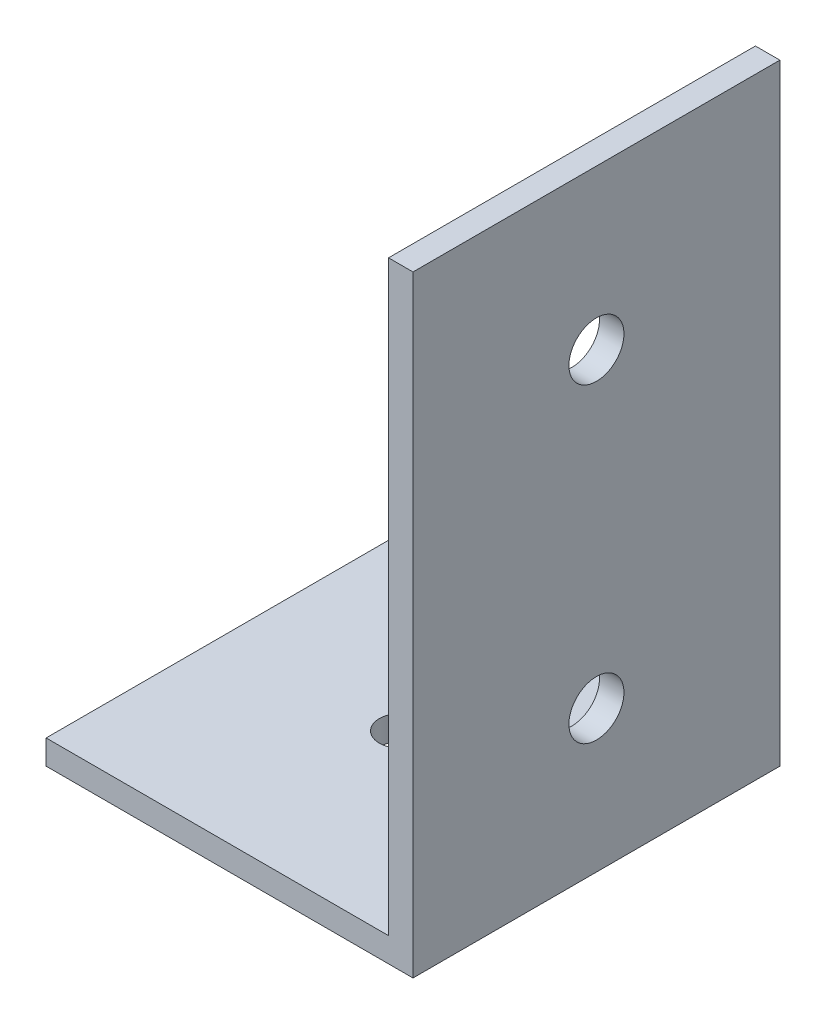
ISO-10303-21;
HEADER;
FILE_DESCRIPTION(('STEP AP214'),'2;1');
FILE_NAME('part.step','',(''),(''),'','','');
FILE_SCHEMA(('AUTOMOTIVE_DESIGN { 1 0 10303 214 1 1 1 1 }'));
ENDSEC;
DATA;
#1=APPLICATION_CONTEXT('core data for automotive mechanical design processes');
#2=APPLICATION_PROTOCOL_DEFINITION('international standard','automotive_design',2000,#1);
#3=PRODUCT_CONTEXT('',#1,'mechanical');
#4=PRODUCT('Part','Part','',(#3));
#5=PRODUCT_RELATED_PRODUCT_CATEGORY('part','',(#4));
#6=PRODUCT_DEFINITION_FORMATION('','',#4);
#7=PRODUCT_DEFINITION_CONTEXT('part definition',#1,'design');
#8=PRODUCT_DEFINITION('design','',#6,#7);
#9=PRODUCT_DEFINITION_SHAPE('','',#8);
#10=(LENGTH_UNIT() NAMED_UNIT(*) SI_UNIT(.MILLI.,.METRE.));
#11=(NAMED_UNIT(*) PLANE_ANGLE_UNIT() SI_UNIT($,.RADIAN.));
#12=(NAMED_UNIT(*) SI_UNIT($,.STERADIAN.) SOLID_ANGLE_UNIT());
#13=UNCERTAINTY_MEASURE_WITH_UNIT(LENGTH_MEASURE(1.E-05),#10,'distance_accuracy_value','');
#14=(GEOMETRIC_REPRESENTATION_CONTEXT(3) GLOBAL_UNCERTAINTY_ASSIGNED_CONTEXT((#13)) GLOBAL_UNIT_ASSIGNED_CONTEXT((#10,
#11,#12)) REPRESENTATION_CONTEXT('',''));
#15=CARTESIAN_POINT('',(0.,0.,0.));
#16=DIRECTION('',(0.,0.,1.));
#17=DIRECTION('',(1.,0.,0.));
#18=AXIS2_PLACEMENT_3D('',#15,#16,#17);
#19=CARTESIAN_POINT('',(0.,50.,30.));
#20=DIRECTION('',(-1.,0.,0.));
#21=DIRECTION('',(0.,-1.,0.));
#22=AXIS2_PLACEMENT_3D('',#19,#20,#21);
#23=PLANE('',#22);
#24=CARTESIAN_POINT('',(0.,11.6,15.));
#25=DIRECTION('',(-1.,0.,0.));
#26=DIRECTION('',(0.,-1.,0.));
#27=AXIS2_PLACEMENT_3D('',#24,#25,#26);
#28=CIRCLE('',#27,2.25);
#29=CARTESIAN_POINT('',(0.,9.35,15.));
#30=VERTEX_POINT('',#29);
#31=EDGE_CURVE('E161',#30,#30,#28,.T.);
#32=ORIENTED_EDGE('',*,*,#31,.T.);
#33=EDGE_LOOP('',(#32));
#34=FACE_BOUND('',#33,.T.);
#35=CARTESIAN_POINT('',(0.,37.,15.));
#36=DIRECTION('',(-1.,0.,0.));
#37=DIRECTION('',(0.,-1.,0.));
#38=AXIS2_PLACEMENT_3D('',#35,#36,#37);
#39=CIRCLE('',#38,2.25);
#40=CARTESIAN_POINT('',(0.,34.75,15.));
#41=VERTEX_POINT('',#40);
#42=EDGE_CURVE('E120',#41,#41,#39,.T.);
#43=ORIENTED_EDGE('',*,*,#42,.T.);
#44=EDGE_LOOP('',(#43));
#45=FACE_BOUND('',#44,.T.);
#46=DIRECTION('',(0.,1.,0.));
#47=VECTOR('',#46,1.);
#48=CARTESIAN_POINT('',(0.,50.,0.));
#49=LINE('',#48,#47);
#50=CARTESIAN_POINT('',(0.,0.,0.));
#51=VERTEX_POINT('',#50);
#52=CARTESIAN_POINT('',(0.,50.,0.));
#53=VERTEX_POINT('',#52);
#54=EDGE_CURVE('E116',#51,#53,#49,.T.);
#55=ORIENTED_EDGE('',*,*,#54,.T.);
#56=DIRECTION('',(0.,0.,-1.));
#57=VECTOR('',#56,1.);
#58=CARTESIAN_POINT('',(0.,50.,30.));
#59=LINE('',#58,#57);
#60=CARTESIAN_POINT('',(0.,50.,30.));
#61=VERTEX_POINT('',#60);
#62=EDGE_CURVE('E11',#61,#53,#59,.T.);
#63=ORIENTED_EDGE('',*,*,#62,.F.);
#64=DIRECTION('',(0.,1.,0.));
#65=VECTOR('',#64,1.);
#66=CARTESIAN_POINT('',(0.,50.,30.));
#67=LINE('',#66,#65);
#68=CARTESIAN_POINT('',(0.,0.,30.));
#69=VERTEX_POINT('',#68);
#70=EDGE_CURVE('E127',#69,#61,#67,.T.);
#71=ORIENTED_EDGE('',*,*,#70,.F.);
#72=DIRECTION('',(0.,0.,-1.));
#73=VECTOR('',#72,1.);
#74=CARTESIAN_POINT('',(0.,0.,30.));
#75=LINE('',#74,#73);
#76=EDGE_CURVE('E112',#69,#51,#75,.T.);
#77=ORIENTED_EDGE('',*,*,#76,.T.);
#78=EDGE_LOOP('',(#55,#63,#71,#77));
#79=FACE_BOUND('',#78,.T.);
#80=ADVANCED_FACE('F32',(#34,#45,#79),#23,.F.);
#81=CARTESIAN_POINT('',(-2.,50.,30.));
#82=DIRECTION('',(0.,-1.,0.));
#83=DIRECTION('',(0.,0.,-1.));
#84=AXIS2_PLACEMENT_3D('',#81,#82,#83);
#85=PLANE('',#84);
#86=DIRECTION('',(-1.,0.,0.));
#87=VECTOR('',#86,1.);
#88=CARTESIAN_POINT('',(-2.,50.,0.));
#89=LINE('',#88,#87);
#90=CARTESIAN_POINT('',(-2.,50.,0.));
#91=VERTEX_POINT('',#90);
#92=EDGE_CURVE('E119',#53,#91,#89,.T.);
#93=ORIENTED_EDGE('',*,*,#92,.T.);
#94=DIRECTION('',(0.,0.,-1.));
#95=VECTOR('',#94,1.);
#96=CARTESIAN_POINT('',(-2.,50.,30.));
#97=LINE('',#96,#95);
#98=CARTESIAN_POINT('',(-2.,50.,30.));
#99=VERTEX_POINT('',#98);
#100=EDGE_CURVE('E40',#99,#91,#97,.T.);
#101=ORIENTED_EDGE('',*,*,#100,.F.);
#102=DIRECTION('',(-1.,0.,0.));
#103=VECTOR('',#102,1.);
#104=CARTESIAN_POINT('',(-2.,50.,30.));
#105=LINE('',#104,#103);
#106=EDGE_CURVE('E85',#61,#99,#105,.T.);
#107=ORIENTED_EDGE('',*,*,#106,.F.);
#108=ORIENTED_EDGE('',*,*,#62,.T.);
#109=EDGE_LOOP('',(#93,#101,#107,#108));
#110=FACE_BOUND('',#109,.T.);
#111=ADVANCED_FACE('F153',(#110),#85,.F.);
#112=CARTESIAN_POINT('',(-2.,2.,30.));
#113=DIRECTION('',(1.,0.,0.));
#114=DIRECTION('',(0.,1.,0.));
#115=AXIS2_PLACEMENT_3D('',#112,#113,#114);
#116=PLANE('',#115);
#117=CARTESIAN_POINT('',(-2.,11.6,15.));
#118=DIRECTION('',(-1.,0.,0.));
#119=DIRECTION('',(0.,-1.,0.));
#120=AXIS2_PLACEMENT_3D('',#117,#118,#119);
#121=CIRCLE('',#120,2.25);
#122=CARTESIAN_POINT('',(-2.,9.35,15.));
#123=VERTEX_POINT('',#122);
#124=EDGE_CURVE('E170',#123,#123,#121,.T.);
#125=ORIENTED_EDGE('',*,*,#124,.F.);
#126=EDGE_LOOP('',(#125));
#127=FACE_BOUND('',#126,.T.);
#128=CARTESIAN_POINT('',(-2.,37.,15.));
#129=DIRECTION('',(-1.,0.,0.));
#130=DIRECTION('',(0.,-1.,0.));
#131=AXIS2_PLACEMENT_3D('',#128,#129,#130);
#132=CIRCLE('',#131,2.25);
#133=CARTESIAN_POINT('',(-2.,34.75,15.));
#134=VERTEX_POINT('',#133);
#135=EDGE_CURVE('E165',#134,#134,#132,.T.);
#136=ORIENTED_EDGE('',*,*,#135,.F.);
#137=EDGE_LOOP('',(#136));
#138=FACE_BOUND('',#137,.T.);
#139=DIRECTION('',(0.,-1.,0.));
#140=VECTOR('',#139,1.);
#141=CARTESIAN_POINT('',(-2.,2.,0.));
#142=LINE('',#141,#140);
#143=CARTESIAN_POINT('',(-2.,2.,0.));
#144=VERTEX_POINT('',#143);
#145=EDGE_CURVE('E122',#91,#144,#142,.T.);
#146=ORIENTED_EDGE('',*,*,#145,.T.);
#147=DIRECTION('',(0.,0.,-1.));
#148=VECTOR('',#147,1.);
#149=CARTESIAN_POINT('',(-2.,2.,30.));
#150=LINE('',#149,#148);
#151=CARTESIAN_POINT('',(-2.,2.,30.));
#152=VERTEX_POINT('',#151);
#153=EDGE_CURVE('E107',#152,#144,#150,.T.);
#154=ORIENTED_EDGE('',*,*,#153,.F.);
#155=DIRECTION('',(0.,-1.,0.));
#156=VECTOR('',#155,1.);
#157=CARTESIAN_POINT('',(-2.,2.,30.));
#158=LINE('',#157,#156);
#159=EDGE_CURVE('E98',#99,#152,#158,.T.);
#160=ORIENTED_EDGE('',*,*,#159,.F.);
#161=ORIENTED_EDGE('',*,*,#100,.T.);
#162=EDGE_LOOP('',(#146,#154,#160,#161));
#163=FACE_BOUND('',#162,.T.);
#164=ADVANCED_FACE('F133',(#127,#138,#163),#116,.F.);
#165=CARTESIAN_POINT('',(-30.,2.,30.));
#166=DIRECTION('',(0.,-1.,0.));
#167=DIRECTION('',(0.,0.,-1.));
#168=AXIS2_PLACEMENT_3D('',#165,#166,#167);
#169=PLANE('',#168);
#170=CARTESIAN_POINT('',(-16.,2.,15.));
#171=DIRECTION('',(0.,1.,0.));
#172=DIRECTION('',(0.,0.,1.));
#173=AXIS2_PLACEMENT_3D('',#170,#171,#172);
#174=CIRCLE('',#173,1.75);
#175=CARTESIAN_POINT('',(-16.,2.,16.75));
#176=VERTEX_POINT('',#175);
#177=EDGE_CURVE('E177',#176,#176,#174,.T.);
#178=ORIENTED_EDGE('',*,*,#177,.F.);
#179=EDGE_LOOP('',(#178));
#180=FACE_BOUND('',#179,.T.);
#181=DIRECTION('',(-1.,0.,0.));
#182=VECTOR('',#181,1.);
#183=CARTESIAN_POINT('',(-30.,2.,0.));
#184=LINE('',#183,#182);
#185=CARTESIAN_POINT('',(-30.,2.,0.));
#186=VERTEX_POINT('',#185);
#187=EDGE_CURVE('E106',#144,#186,#184,.T.);
#188=ORIENTED_EDGE('',*,*,#187,.T.);
#189=DIRECTION('',(0.,0.,-1.));
#190=VECTOR('',#189,1.);
#191=CARTESIAN_POINT('',(-30.,2.,30.));
#192=LINE('',#191,#190);
#193=CARTESIAN_POINT('',(-30.,2.,30.));
#194=VERTEX_POINT('',#193);
#195=EDGE_CURVE('E103',#194,#186,#192,.T.);
#196=ORIENTED_EDGE('',*,*,#195,.F.);
#197=DIRECTION('',(-1.,0.,0.));
#198=VECTOR('',#197,1.);
#199=CARTESIAN_POINT('',(-30.,2.,30.));
#200=LINE('',#199,#198);
#201=EDGE_CURVE('E92',#152,#194,#200,.T.);
#202=ORIENTED_EDGE('',*,*,#201,.F.);
#203=ORIENTED_EDGE('',*,*,#153,.T.);
#204=EDGE_LOOP('',(#188,#196,#202,#203));
#205=FACE_BOUND('',#204,.T.);
#206=ADVANCED_FACE('F104',(#180,#205),#169,.F.);
#207=CARTESIAN_POINT('',(-30.,0.,30.));
#208=DIRECTION('',(1.,0.,0.));
#209=DIRECTION('',(0.,0.,-1.));
#210=AXIS2_PLACEMENT_3D('',#207,#208,#209);
#211=PLANE('',#210);
#212=DIRECTION('',(0.,-1.,0.));
#213=VECTOR('',#212,1.);
#214=CARTESIAN_POINT('',(-30.,0.,0.));
#215=LINE('',#214,#213);
#216=CARTESIAN_POINT('',(-30.,0.,0.));
#217=VERTEX_POINT('',#216);
#218=EDGE_CURVE('E71',#186,#217,#215,.T.);
#219=ORIENTED_EDGE('',*,*,#218,.T.);
#220=DIRECTION('',(0.,0.,-1.));
#221=VECTOR('',#220,1.);
#222=CARTESIAN_POINT('',(-30.,0.,30.));
#223=LINE('',#222,#221);
#224=CARTESIAN_POINT('',(-30.,0.,30.));
#225=VERTEX_POINT('',#224);
#226=EDGE_CURVE('E108',#225,#217,#223,.T.);
#227=ORIENTED_EDGE('',*,*,#226,.F.);
#228=DIRECTION('',(0.,-1.,0.));
#229=VECTOR('',#228,1.);
#230=CARTESIAN_POINT('',(-30.,0.,30.));
#231=LINE('',#230,#229);
#232=EDGE_CURVE('E96',#194,#225,#231,.T.);
#233=ORIENTED_EDGE('',*,*,#232,.F.);
#234=ORIENTED_EDGE('',*,*,#195,.T.);
#235=EDGE_LOOP('',(#219,#227,#233,#234));
#236=FACE_BOUND('',#235,.T.);
#237=ADVANCED_FACE('F110',(#236),#211,.F.);
#238=CARTESIAN_POINT('',(0.,0.,30.));
#239=DIRECTION('',(0.,1.,0.));
#240=DIRECTION('',(-1.,0.,0.));
#241=AXIS2_PLACEMENT_3D('',#238,#239,#240);
#242=PLANE('',#241);
#243=CARTESIAN_POINT('',(-16.,0.,15.));
#244=DIRECTION('',(0.,1.,0.));
#245=DIRECTION('',(0.,0.,1.));
#246=AXIS2_PLACEMENT_3D('',#243,#244,#245);
#247=CIRCLE('',#246,1.75);
#248=CARTESIAN_POINT('',(-16.,0.,16.75));
#249=VERTEX_POINT('',#248);
#250=EDGE_CURVE('E175',#249,#249,#247,.T.);
#251=ORIENTED_EDGE('',*,*,#250,.T.);
#252=EDGE_LOOP('',(#251));
#253=FACE_BOUND('',#252,.T.);
#254=DIRECTION('',(1.,0.,0.));
#255=VECTOR('',#254,1.);
#256=CARTESIAN_POINT('',(0.,0.,0.));
#257=LINE('',#256,#255);
#258=EDGE_CURVE('E77',#217,#51,#257,.T.);
#259=ORIENTED_EDGE('',*,*,#258,.T.);
#260=ORIENTED_EDGE('',*,*,#76,.F.);
#261=DIRECTION('',(1.,0.,0.));
#262=VECTOR('',#261,1.);
#263=CARTESIAN_POINT('',(0.,0.,30.));
#264=LINE('',#263,#262);
#265=EDGE_CURVE('E48',#225,#69,#264,.T.);
#266=ORIENTED_EDGE('',*,*,#265,.F.);
#267=ORIENTED_EDGE('',*,*,#226,.T.);
#268=EDGE_LOOP('',(#259,#260,#266,#267));
#269=FACE_BOUND('',#268,.T.);
#270=ADVANCED_FACE('F140',(#253,#269),#242,.F.);
#271=CARTESIAN_POINT('',(0.,0.,30.));
#272=DIRECTION('',(0.,0.,-1.));
#273=DIRECTION('',(-1.,0.,0.));
#274=AXIS2_PLACEMENT_3D('',#271,#272,#273);
#275=PLANE('',#274);
#276=ORIENTED_EDGE('',*,*,#70,.T.);
#277=ORIENTED_EDGE('',*,*,#106,.T.);
#278=ORIENTED_EDGE('',*,*,#159,.T.);
#279=ORIENTED_EDGE('',*,*,#201,.T.);
#280=ORIENTED_EDGE('',*,*,#232,.T.);
#281=ORIENTED_EDGE('',*,*,#265,.T.);
#282=EDGE_LOOP('',(#276,#277,#278,#279,#280,#281));
#283=FACE_BOUND('',#282,.T.);
#284=ADVANCED_FACE('F94',(#283),#275,.F.);
#285=CARTESIAN_POINT('',(0.,0.,0.));
#286=DIRECTION('',(0.,0.,-1.));
#287=DIRECTION('',(-1.,0.,0.));
#288=AXIS2_PLACEMENT_3D('',#285,#286,#287);
#289=PLANE('',#288);
#290=ORIENTED_EDGE('',*,*,#54,.F.);
#291=ORIENTED_EDGE('',*,*,#258,.F.);
#292=ORIENTED_EDGE('',*,*,#218,.F.);
#293=ORIENTED_EDGE('',*,*,#187,.F.);
#294=ORIENTED_EDGE('',*,*,#145,.F.);
#295=ORIENTED_EDGE('',*,*,#92,.F.);
#296=EDGE_LOOP('',(#290,#291,#292,#293,#294,#295));
#297=FACE_BOUND('',#296,.T.);
#298=ADVANCED_FACE('F136',(#297),#289,.T.);
#299=CARTESIAN_POINT('',(0.,37.,15.));
#300=DIRECTION('',(-1.,0.,0.));
#301=DIRECTION('',(0.,-1.,0.));
#302=AXIS2_PLACEMENT_3D('',#299,#300,#301);
#303=CYLINDRICAL_SURFACE('',#302,2.25);
#304=ORIENTED_EDGE('',*,*,#42,.F.);
#305=EDGE_LOOP('',(#304));
#306=FACE_BOUND('',#305,.T.);
#307=ORIENTED_EDGE('',*,*,#135,.T.);
#308=EDGE_LOOP('',(#307));
#309=FACE_BOUND('',#308,.T.);
#310=ADVANCED_FACE('F202',(#306,#309),#303,.F.);
#311=CARTESIAN_POINT('',(0.,11.6,15.));
#312=DIRECTION('',(-1.,0.,0.));
#313=DIRECTION('',(0.,-1.,0.));
#314=AXIS2_PLACEMENT_3D('',#311,#312,#313);
#315=CYLINDRICAL_SURFACE('',#314,2.25);
#316=ORIENTED_EDGE('',*,*,#31,.F.);
#317=EDGE_LOOP('',(#316));
#318=FACE_BOUND('',#317,.T.);
#319=ORIENTED_EDGE('',*,*,#124,.T.);
#320=EDGE_LOOP('',(#319));
#321=FACE_BOUND('',#320,.T.);
#322=ADVANCED_FACE('F185',(#318,#321),#315,.F.);
#323=CARTESIAN_POINT('',(-16.,0.,15.));
#324=DIRECTION('',(0.,1.,0.));
#325=DIRECTION('',(0.,0.,1.));
#326=AXIS2_PLACEMENT_3D('',#323,#324,#325);
#327=CYLINDRICAL_SURFACE('',#326,1.75);
#328=ORIENTED_EDGE('',*,*,#250,.F.);
#329=EDGE_LOOP('',(#328));
#330=FACE_BOUND('',#329,.T.);
#331=ORIENTED_EDGE('',*,*,#177,.T.);
#332=EDGE_LOOP('',(#331));
#333=FACE_BOUND('',#332,.T.);
#334=ADVANCED_FACE('F182',(#330,#333),#327,.F.);
#335=CLOSED_SHELL('',(#80,#111,#164,#206,#237,#270,#284,#298,#310,#322,#334));
#336=MANIFOLD_SOLID_BREP('B2',#335);
#337=ADVANCED_BREP_SHAPE_REPRESENTATION('',(#18,#336),#14);
#338=SHAPE_DEFINITION_REPRESENTATION(#9,#337);
ENDSEC;
END-ISO-10303-21;
